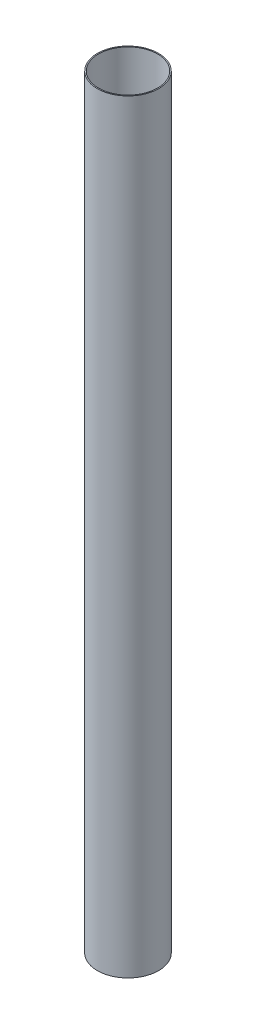
ISO-10303-21;
HEADER;
FILE_DESCRIPTION(('STEP AP214'),'2;1');
FILE_NAME('part.step','',(''),(''),'','','');
FILE_SCHEMA(('AUTOMOTIVE_DESIGN { 1 0 10303 214 1 1 1 1 }'));
ENDSEC;
DATA;
#1=APPLICATION_CONTEXT('core data for automotive mechanical design processes');
#2=APPLICATION_PROTOCOL_DEFINITION('international standard','automotive_design',2000,#1);
#3=PRODUCT_CONTEXT('',#1,'mechanical');
#4=PRODUCT('Part','Part','',(#3));
#5=PRODUCT_RELATED_PRODUCT_CATEGORY('part','',(#4));
#6=PRODUCT_DEFINITION_FORMATION('','',#4);
#7=PRODUCT_DEFINITION_CONTEXT('part definition',#1,'design');
#8=PRODUCT_DEFINITION('design','',#6,#7);
#9=PRODUCT_DEFINITION_SHAPE('','',#8);
#10=(LENGTH_UNIT() NAMED_UNIT(*) SI_UNIT(.MILLI.,.METRE.));
#11=(NAMED_UNIT(*) PLANE_ANGLE_UNIT() SI_UNIT($,.RADIAN.));
#12=(NAMED_UNIT(*) SI_UNIT($,.STERADIAN.) SOLID_ANGLE_UNIT());
#13=UNCERTAINTY_MEASURE_WITH_UNIT(LENGTH_MEASURE(1.E-05),#10,'distance_accuracy_value','');
#14=(GEOMETRIC_REPRESENTATION_CONTEXT(3) GLOBAL_UNCERTAINTY_ASSIGNED_CONTEXT((#13)) GLOBAL_UNIT_ASSIGNED_CONTEXT((#10,
#11,#12)) REPRESENTATION_CONTEXT('',''));
#15=CARTESIAN_POINT('',(0.,0.,0.));
#16=DIRECTION('',(0.,0.,1.));
#17=DIRECTION('',(1.,0.,0.));
#18=AXIS2_PLACEMENT_3D('',#15,#16,#17);
#19=CARTESIAN_POINT('',(0.,1060.,0.));
#20=DIRECTION('',(0.,1.,0.));
#21=DIRECTION('',(0.,0.,1.));
#22=AXIS2_PLACEMENT_3D('',#19,#20,#21);
#23=PLANE('',#22);
#24=CARTESIAN_POINT('',(0.,1060.,0.));
#25=DIRECTION('',(0.,1.,0.));
#26=DIRECTION('',(0.,0.,1.));
#27=AXIS2_PLACEMENT_3D('',#24,#25,#26);
#28=CIRCLE('',#27,42.5);
#29=CARTESIAN_POINT('',(0.,1060.,42.5));
#30=VERTEX_POINT('',#29);
#31=EDGE_CURVE('E10',#30,#30,#28,.T.);
#32=ORIENTED_EDGE('',*,*,#31,.T.);
#33=EDGE_LOOP('',(#32));
#34=FACE_BOUND('',#33,.T.);
#35=CARTESIAN_POINT('',(0.,1060.,0.));
#36=DIRECTION('',(0.,1.,0.));
#37=DIRECTION('',(0.,0.,1.));
#38=AXIS2_PLACEMENT_3D('',#35,#36,#37);
#39=CIRCLE('',#38,41.);
#40=CARTESIAN_POINT('',(0.,1060.,41.));
#41=VERTEX_POINT('',#40);
#42=EDGE_CURVE('E48',#41,#41,#39,.T.);
#43=ORIENTED_EDGE('',*,*,#42,.F.);
#44=EDGE_LOOP('',(#43));
#45=FACE_BOUND('',#44,.T.);
#46=ADVANCED_FACE('F37',(#34,#45),#23,.T.);
#47=CARTESIAN_POINT('',(0.,0.,0.));
#48=DIRECTION('',(0.,1.,0.));
#49=DIRECTION('',(0.,0.,1.));
#50=AXIS2_PLACEMENT_3D('',#47,#48,#49);
#51=PLANE('',#50);
#52=CARTESIAN_POINT('',(0.,0.,0.));
#53=DIRECTION('',(0.,1.,0.));
#54=DIRECTION('',(0.,0.,1.));
#55=AXIS2_PLACEMENT_3D('',#52,#53,#54);
#56=CIRCLE('',#55,42.5);
#57=CARTESIAN_POINT('',(0.,0.,42.5));
#58=VERTEX_POINT('',#57);
#59=EDGE_CURVE('E41',#58,#58,#56,.T.);
#60=ORIENTED_EDGE('',*,*,#59,.F.);
#61=EDGE_LOOP('',(#60));
#62=FACE_BOUND('',#61,.T.);
#63=CARTESIAN_POINT('',(0.,0.,0.));
#64=DIRECTION('',(0.,1.,0.));
#65=DIRECTION('',(0.,0.,1.));
#66=AXIS2_PLACEMENT_3D('',#63,#64,#65);
#67=CIRCLE('',#66,41.);
#68=CARTESIAN_POINT('',(0.,0.,41.));
#69=VERTEX_POINT('',#68);
#70=EDGE_CURVE('E50',#69,#69,#67,.T.);
#71=ORIENTED_EDGE('',*,*,#70,.T.);
#72=EDGE_LOOP('',(#71));
#73=FACE_BOUND('',#72,.T.);
#74=ADVANCED_FACE('F60',(#62,#73),#51,.F.);
#75=CARTESIAN_POINT('',(0.,1060.,0.));
#76=DIRECTION('',(0.,-1.,0.));
#77=DIRECTION('',(0.,0.,-1.));
#78=AXIS2_PLACEMENT_3D('',#75,#76,#77);
#79=CYLINDRICAL_SURFACE('',#78,42.5);
#80=ORIENTED_EDGE('',*,*,#31,.F.);
#81=EDGE_LOOP('',(#80));
#82=FACE_BOUND('',#81,.T.);
#83=ORIENTED_EDGE('',*,*,#59,.T.);
#84=EDGE_LOOP('',(#83));
#85=FACE_BOUND('',#84,.T.);
#86=ADVANCED_FACE('F39',(#82,#85),#79,.T.);
#87=CARTESIAN_POINT('',(0.,1060.,0.));
#88=DIRECTION('',(0.,-1.,0.));
#89=DIRECTION('',(0.,0.,-1.));
#90=AXIS2_PLACEMENT_3D('',#87,#88,#89);
#91=CYLINDRICAL_SURFACE('',#90,41.);
#92=ORIENTED_EDGE('',*,*,#42,.T.);
#93=EDGE_LOOP('',(#92));
#94=FACE_BOUND('',#93,.T.);
#95=ORIENTED_EDGE('',*,*,#70,.F.);
#96=EDGE_LOOP('',(#95));
#97=FACE_BOUND('',#96,.T.);
#98=ADVANCED_FACE('F56',(#94,#97),#91,.F.);
#99=CLOSED_SHELL('',(#46,#74,#86,#98));
#100=MANIFOLD_SOLID_BREP('B2',#99);
#101=ADVANCED_BREP_SHAPE_REPRESENTATION('',(#18,#100),#14);
#102=SHAPE_DEFINITION_REPRESENTATION(#9,#101);
ENDSEC;
END-ISO-10303-21;
